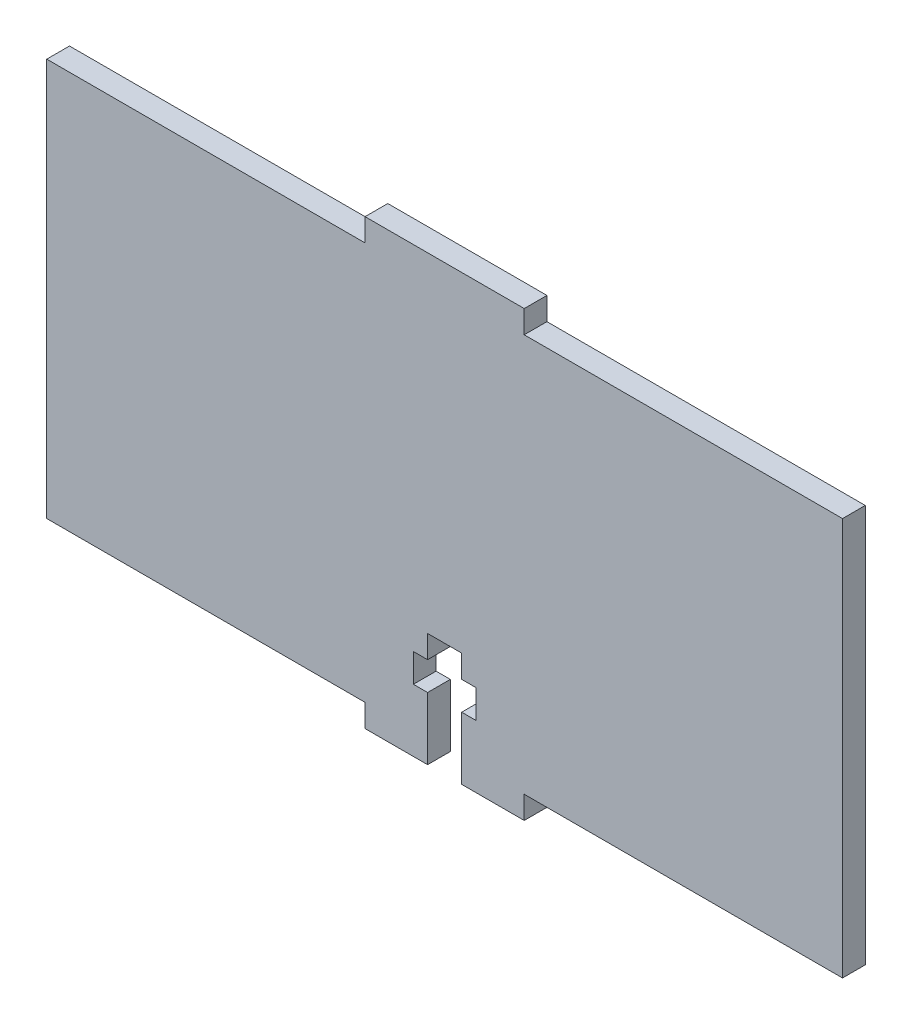
ISO-10303-21;
HEADER;
FILE_DESCRIPTION(('STEP AP214'),'2;1');
FILE_NAME('part.step','',(''),(''),'','','');
FILE_SCHEMA(('AUTOMOTIVE_DESIGN { 1 0 10303 214 1 1 1 1 }'));
ENDSEC;
DATA;
#1=APPLICATION_CONTEXT('core data for automotive mechanical design processes');
#2=APPLICATION_PROTOCOL_DEFINITION('international standard','automotive_design',2000,#1);
#3=PRODUCT_CONTEXT('',#1,'mechanical');
#4=PRODUCT('Part','Part','',(#3));
#5=PRODUCT_RELATED_PRODUCT_CATEGORY('part','',(#4));
#6=PRODUCT_DEFINITION_FORMATION('','',#4);
#7=PRODUCT_DEFINITION_CONTEXT('part definition',#1,'design');
#8=PRODUCT_DEFINITION('design','',#6,#7);
#9=PRODUCT_DEFINITION_SHAPE('','',#8);
#10=(LENGTH_UNIT() NAMED_UNIT(*) SI_UNIT(.MILLI.,.METRE.));
#11=(NAMED_UNIT(*) PLANE_ANGLE_UNIT() SI_UNIT($,.RADIAN.));
#12=(NAMED_UNIT(*) SI_UNIT($,.STERADIAN.) SOLID_ANGLE_UNIT());
#13=UNCERTAINTY_MEASURE_WITH_UNIT(LENGTH_MEASURE(1.E-05),#10,'distance_accuracy_value','');
#14=(GEOMETRIC_REPRESENTATION_CONTEXT(3) GLOBAL_UNCERTAINTY_ASSIGNED_CONTEXT((#13)) GLOBAL_UNIT_ASSIGNED_CONTEXT((#10,
#11,#12)) REPRESENTATION_CONTEXT('',''));
#15=CARTESIAN_POINT('',(0.,0.,0.));
#16=DIRECTION('',(0.,0.,1.));
#17=DIRECTION('',(1.,0.,0.));
#18=AXIS2_PLACEMENT_3D('',#15,#16,#17);
#19=CARTESIAN_POINT('',(0.,0.,2.));
#20=DIRECTION('',(1.,0.,0.));
#21=DIRECTION('',(0.,0.,-1.));
#22=AXIS2_PLACEMENT_3D('',#19,#20,#21);
#23=PLANE('',#22);
#24=DIRECTION('',(0.,-1.,0.));
#25=VECTOR('',#24,1.);
#26=CARTESIAN_POINT('',(0.,0.,0.));
#27=LINE('',#26,#25);
#28=CARTESIAN_POINT('',(0.,35.,0.));
#29=VERTEX_POINT('',#28);
#30=CARTESIAN_POINT('',(0.,0.,0.));
#31=VERTEX_POINT('',#30);
#32=EDGE_CURVE('E224',#29,#31,#27,.T.);
#33=ORIENTED_EDGE('',*,*,#32,.T.);
#34=DIRECTION('',(0.,0.,-1.));
#35=VECTOR('',#34,1.);
#36=CARTESIAN_POINT('',(0.,0.,2.));
#37=LINE('',#36,#35);
#38=CARTESIAN_POINT('',(0.,0.,2.));
#39=VERTEX_POINT('',#38);
#40=EDGE_CURVE('E11',#39,#31,#37,.T.);
#41=ORIENTED_EDGE('',*,*,#40,.F.);
#42=DIRECTION('',(0.,-1.,0.));
#43=VECTOR('',#42,1.);
#44=CARTESIAN_POINT('',(0.,0.,2.));
#45=LINE('',#44,#43);
#46=CARTESIAN_POINT('',(0.,35.,2.));
#47=VERTEX_POINT('',#46);
#48=EDGE_CURVE('E270',#47,#39,#45,.T.);
#49=ORIENTED_EDGE('',*,*,#48,.F.);
#50=DIRECTION('',(0.,0.,-1.));
#51=VECTOR('',#50,1.);
#52=CARTESIAN_POINT('',(0.,35.,2.));
#53=LINE('',#52,#51);
#54=EDGE_CURVE('E220',#47,#29,#53,.T.);
#55=ORIENTED_EDGE('',*,*,#54,.T.);
#56=EDGE_LOOP('',(#33,#41,#49,#55));
#57=FACE_BOUND('',#56,.T.);
#58=ADVANCED_FACE('F32',(#57),#23,.F.);
#59=CARTESIAN_POINT('',(0.,0.,2.));
#60=DIRECTION('',(0.,1.,0.));
#61=DIRECTION('',(0.,0.,1.));
#62=AXIS2_PLACEMENT_3D('',#59,#60,#61);
#63=PLANE('',#62);
#64=DIRECTION('',(1.,0.,0.));
#65=VECTOR('',#64,1.);
#66=CARTESIAN_POINT('',(0.,0.,0.));
#67=LINE('',#66,#65);
#68=CARTESIAN_POINT('',(28.,0.,0.));
#69=VERTEX_POINT('',#68);
#70=EDGE_CURVE('E227',#31,#69,#67,.T.);
#71=ORIENTED_EDGE('',*,*,#70,.T.);
#72=DIRECTION('',(0.,0.,-1.));
#73=VECTOR('',#72,1.);
#74=CARTESIAN_POINT('',(28.,0.,2.));
#75=LINE('',#74,#73);
#76=CARTESIAN_POINT('',(28.,0.,2.));
#77=VERTEX_POINT('',#76);
#78=EDGE_CURVE('E40',#77,#69,#75,.T.);
#79=ORIENTED_EDGE('',*,*,#78,.F.);
#80=DIRECTION('',(1.,0.,0.));
#81=VECTOR('',#80,1.);
#82=CARTESIAN_POINT('',(0.,0.,2.));
#83=LINE('',#82,#81);
#84=EDGE_CURVE('E139',#39,#77,#83,.T.);
#85=ORIENTED_EDGE('',*,*,#84,.F.);
#86=ORIENTED_EDGE('',*,*,#40,.T.);
#87=EDGE_LOOP('',(#71,#79,#85,#86));
#88=FACE_BOUND('',#87,.T.);
#89=ADVANCED_FACE('F408',(#88),#63,.F.);
#90=CARTESIAN_POINT('',(28.,0.,2.));
#91=DIRECTION('',(1.,0.,0.));
#92=DIRECTION('',(0.,1.,0.));
#93=AXIS2_PLACEMENT_3D('',#90,#91,#92);
#94=PLANE('',#93);
#95=DIRECTION('',(0.,-1.,0.));
#96=VECTOR('',#95,1.);
#97=CARTESIAN_POINT('',(28.,0.,0.));
#98=LINE('',#97,#96);
#99=CARTESIAN_POINT('',(28.,-2.,0.));
#100=VERTEX_POINT('',#99);
#101=EDGE_CURVE('E229',#69,#100,#98,.T.);
#102=ORIENTED_EDGE('',*,*,#101,.T.);
#103=DIRECTION('',(0.,0.,-1.));
#104=VECTOR('',#103,1.);
#105=CARTESIAN_POINT('',(28.,-2.,2.));
#106=LINE('',#105,#104);
#107=CARTESIAN_POINT('',(28.,-2.,2.));
#108=VERTEX_POINT('',#107);
#109=EDGE_CURVE('E325',#108,#100,#106,.T.);
#110=ORIENTED_EDGE('',*,*,#109,.F.);
#111=DIRECTION('',(0.,-1.,0.));
#112=VECTOR('',#111,1.);
#113=CARTESIAN_POINT('',(28.,0.,2.));
#114=LINE('',#113,#112);
#115=EDGE_CURVE('E333',#77,#108,#114,.T.);
#116=ORIENTED_EDGE('',*,*,#115,.F.);
#117=ORIENTED_EDGE('',*,*,#78,.T.);
#118=EDGE_LOOP('',(#102,#110,#116,#117));
#119=FACE_BOUND('',#118,.T.);
#120=ADVANCED_FACE('F331',(#119),#94,.F.);
#121=CARTESIAN_POINT('',(28.,-2.,2.));
#122=DIRECTION('',(0.,1.,0.));
#123=DIRECTION('',(0.,0.,1.));
#124=AXIS2_PLACEMENT_3D('',#121,#122,#123);
#125=PLANE('',#124);
#126=DIRECTION('',(1.,0.,0.));
#127=VECTOR('',#126,1.);
#128=CARTESIAN_POINT('',(28.,-2.,0.));
#129=LINE('',#128,#127);
#130=CARTESIAN_POINT('',(33.5,-2.,0.));
#131=VERTEX_POINT('',#130);
#132=EDGE_CURVE('E231',#100,#131,#129,.T.);
#133=ORIENTED_EDGE('',*,*,#132,.T.);
#134=DIRECTION('',(0.,0.,-1.));
#135=VECTOR('',#134,1.);
#136=CARTESIAN_POINT('',(33.5,-2.,2.));
#137=LINE('',#136,#135);
#138=CARTESIAN_POINT('',(33.5,-2.,2.));
#139=VERTEX_POINT('',#138);
#140=EDGE_CURVE('E322',#139,#131,#137,.T.);
#141=ORIENTED_EDGE('',*,*,#140,.F.);
#142=DIRECTION('',(1.,0.,0.));
#143=VECTOR('',#142,1.);
#144=CARTESIAN_POINT('',(28.,-2.,2.));
#145=LINE('',#144,#143);
#146=EDGE_CURVE('E351',#108,#139,#145,.T.);
#147=ORIENTED_EDGE('',*,*,#146,.F.);
#148=ORIENTED_EDGE('',*,*,#109,.T.);
#149=EDGE_LOOP('',(#133,#141,#147,#148));
#150=FACE_BOUND('',#149,.T.);
#151=ADVANCED_FACE('F342',(#150),#125,.F.);
#152=CARTESIAN_POINT('',(33.5,-2.,2.));
#153=DIRECTION('',(-1.,0.,0.));
#154=DIRECTION('',(0.,0.,1.));
#155=AXIS2_PLACEMENT_3D('',#152,#153,#154);
#156=PLANE('',#155);
#157=DIRECTION('',(0.,1.,0.));
#158=VECTOR('',#157,1.);
#159=CARTESIAN_POINT('',(33.5,-2.,0.));
#160=LINE('',#159,#158);
#161=CARTESIAN_POINT('',(33.5,3.5,0.));
#162=VERTEX_POINT('',#161);
#163=EDGE_CURVE('E233',#131,#162,#160,.T.);
#164=ORIENTED_EDGE('',*,*,#163,.T.);
#165=DIRECTION('',(0.,0.,-1.));
#166=VECTOR('',#165,1.);
#167=CARTESIAN_POINT('',(33.5,3.5,2.));
#168=LINE('',#167,#166);
#169=CARTESIAN_POINT('',(33.5,3.5,2.));
#170=VERTEX_POINT('',#169);
#171=EDGE_CURVE('E319',#170,#162,#168,.T.);
#172=ORIENTED_EDGE('',*,*,#171,.F.);
#173=DIRECTION('',(0.,1.,0.));
#174=VECTOR('',#173,1.);
#175=CARTESIAN_POINT('',(33.5,-2.,2.));
#176=LINE('',#175,#174);
#177=EDGE_CURVE('E348',#139,#170,#176,.T.);
#178=ORIENTED_EDGE('',*,*,#177,.F.);
#179=ORIENTED_EDGE('',*,*,#140,.T.);
#180=EDGE_LOOP('',(#164,#172,#178,#179));
#181=FACE_BOUND('',#180,.T.);
#182=ADVANCED_FACE('F346',(#181),#156,.F.);
#183=CARTESIAN_POINT('',(33.5,3.5,2.));
#184=DIRECTION('',(0.,-1.,0.));
#185=DIRECTION('',(1.,0.,0.));
#186=AXIS2_PLACEMENT_3D('',#183,#184,#185);
#187=PLANE('',#186);
#188=DIRECTION('',(-1.,0.,0.));
#189=VECTOR('',#188,1.);
#190=CARTESIAN_POINT('',(33.5,3.5,0.));
#191=LINE('',#190,#189);
#192=CARTESIAN_POINT('',(32.25,3.5,0.));
#193=VERTEX_POINT('',#192);
#194=EDGE_CURVE('E235',#162,#193,#191,.T.);
#195=ORIENTED_EDGE('',*,*,#194,.T.);
#196=DIRECTION('',(0.,0.,-1.));
#197=VECTOR('',#196,1.);
#198=CARTESIAN_POINT('',(32.25,3.5,2.));
#199=LINE('',#198,#197);
#200=CARTESIAN_POINT('',(32.25,3.5,2.));
#201=VERTEX_POINT('',#200);
#202=EDGE_CURVE('E316',#201,#193,#199,.T.);
#203=ORIENTED_EDGE('',*,*,#202,.F.);
#204=DIRECTION('',(-1.,0.,0.));
#205=VECTOR('',#204,1.);
#206=CARTESIAN_POINT('',(33.5,3.5,2.));
#207=LINE('',#206,#205);
#208=EDGE_CURVE('E350',#170,#201,#207,.T.);
#209=ORIENTED_EDGE('',*,*,#208,.F.);
#210=ORIENTED_EDGE('',*,*,#171,.T.);
#211=EDGE_LOOP('',(#195,#203,#209,#210));
#212=FACE_BOUND('',#211,.T.);
#213=ADVANCED_FACE('F421',(#212),#187,.F.);
#214=CARTESIAN_POINT('',(32.25,3.5,2.));
#215=DIRECTION('',(-1.,0.,0.));
#216=DIRECTION('',(0.,0.,1.));
#217=AXIS2_PLACEMENT_3D('',#214,#215,#216);
#218=PLANE('',#217);
#219=DIRECTION('',(0.,1.,0.));
#220=VECTOR('',#219,1.);
#221=CARTESIAN_POINT('',(32.25,3.5,0.));
#222=LINE('',#221,#220);
#223=CARTESIAN_POINT('',(32.25,6.,0.));
#224=VERTEX_POINT('',#223);
#225=EDGE_CURVE('E237',#193,#224,#222,.T.);
#226=ORIENTED_EDGE('',*,*,#225,.T.);
#227=DIRECTION('',(0.,0.,-1.));
#228=VECTOR('',#227,1.);
#229=CARTESIAN_POINT('',(32.25,6.,2.));
#230=LINE('',#229,#228);
#231=CARTESIAN_POINT('',(32.25,6.,2.));
#232=VERTEX_POINT('',#231);
#233=EDGE_CURVE('E313',#232,#224,#230,.T.);
#234=ORIENTED_EDGE('',*,*,#233,.F.);
#235=DIRECTION('',(0.,1.,0.));
#236=VECTOR('',#235,1.);
#237=CARTESIAN_POINT('',(32.25,3.5,2.));
#238=LINE('',#237,#236);
#239=EDGE_CURVE('E353',#201,#232,#238,.T.);
#240=ORIENTED_EDGE('',*,*,#239,.F.);
#241=ORIENTED_EDGE('',*,*,#202,.T.);
#242=EDGE_LOOP('',(#226,#234,#240,#241));
#243=FACE_BOUND('',#242,.T.);
#244=ADVANCED_FACE('F424',(#243),#218,.F.);
#245=CARTESIAN_POINT('',(32.25,6.,2.));
#246=DIRECTION('',(0.,1.,0.));
#247=DIRECTION('',(0.,0.,1.));
#248=AXIS2_PLACEMENT_3D('',#245,#246,#247);
#249=PLANE('',#248);
#250=DIRECTION('',(1.,0.,0.));
#251=VECTOR('',#250,1.);
#252=CARTESIAN_POINT('',(32.25,6.,0.));
#253=LINE('',#252,#251);
#254=CARTESIAN_POINT('',(33.5,6.,0.));
#255=VERTEX_POINT('',#254);
#256=EDGE_CURVE('E239',#224,#255,#253,.T.);
#257=ORIENTED_EDGE('',*,*,#256,.T.);
#258=DIRECTION('',(0.,0.,-1.));
#259=VECTOR('',#258,1.);
#260=CARTESIAN_POINT('',(33.5,6.,2.));
#261=LINE('',#260,#259);
#262=CARTESIAN_POINT('',(33.5,6.,2.));
#263=VERTEX_POINT('',#262);
#264=EDGE_CURVE('E310',#263,#255,#261,.T.);
#265=ORIENTED_EDGE('',*,*,#264,.F.);
#266=DIRECTION('',(1.,0.,0.));
#267=VECTOR('',#266,1.);
#268=CARTESIAN_POINT('',(32.25,6.,2.));
#269=LINE('',#268,#267);
#270=EDGE_CURVE('E359',#232,#263,#269,.T.);
#271=ORIENTED_EDGE('',*,*,#270,.F.);
#272=ORIENTED_EDGE('',*,*,#233,.T.);
#273=EDGE_LOOP('',(#257,#265,#271,#272));
#274=FACE_BOUND('',#273,.T.);
#275=ADVANCED_FACE('F428',(#274),#249,.F.);
#276=CARTESIAN_POINT('',(33.5,8.,2.));
#277=DIRECTION('',(-1.,0.,0.));
#278=DIRECTION('',(0.,0.,1.));
#279=AXIS2_PLACEMENT_3D('',#276,#277,#278);
#280=PLANE('',#279);
#281=DIRECTION('',(0.,1.,0.));
#282=VECTOR('',#281,1.);
#283=CARTESIAN_POINT('',(33.5,8.,0.));
#284=LINE('',#283,#282);
#285=CARTESIAN_POINT('',(33.5,8.,0.));
#286=VERTEX_POINT('',#285);
#287=EDGE_CURVE('E241',#255,#286,#284,.T.);
#288=ORIENTED_EDGE('',*,*,#287,.T.);
#289=DIRECTION('',(0.,0.,-1.));
#290=VECTOR('',#289,1.);
#291=CARTESIAN_POINT('',(33.5,8.,2.));
#292=LINE('',#291,#290);
#293=CARTESIAN_POINT('',(33.5,8.,2.));
#294=VERTEX_POINT('',#293);
#295=EDGE_CURVE('E307',#294,#286,#292,.T.);
#296=ORIENTED_EDGE('',*,*,#295,.F.);
#297=DIRECTION('',(0.,1.,0.));
#298=VECTOR('',#297,1.);
#299=CARTESIAN_POINT('',(33.5,8.,2.));
#300=LINE('',#299,#298);
#301=EDGE_CURVE('E361',#263,#294,#300,.T.);
#302=ORIENTED_EDGE('',*,*,#301,.F.);
#303=ORIENTED_EDGE('',*,*,#264,.T.);
#304=EDGE_LOOP('',(#288,#296,#302,#303));
#305=FACE_BOUND('',#304,.T.);
#306=ADVANCED_FACE('F432',(#305),#280,.F.);
#307=CARTESIAN_POINT('',(36.5,8.,2.));
#308=DIRECTION('',(0.,1.,0.));
#309=DIRECTION('',(0.,0.,1.));
#310=AXIS2_PLACEMENT_3D('',#307,#308,#309);
#311=PLANE('',#310);
#312=DIRECTION('',(1.,0.,0.));
#313=VECTOR('',#312,1.);
#314=CARTESIAN_POINT('',(36.5,8.,0.));
#315=LINE('',#314,#313);
#316=CARTESIAN_POINT('',(36.5,8.,0.));
#317=VERTEX_POINT('',#316);
#318=EDGE_CURVE('E243',#286,#317,#315,.T.);
#319=ORIENTED_EDGE('',*,*,#318,.T.);
#320=DIRECTION('',(0.,0.,-1.));
#321=VECTOR('',#320,1.);
#322=CARTESIAN_POINT('',(36.5,8.,2.));
#323=LINE('',#322,#321);
#324=CARTESIAN_POINT('',(36.5,8.,2.));
#325=VERTEX_POINT('',#324);
#326=EDGE_CURVE('E304',#325,#317,#323,.T.);
#327=ORIENTED_EDGE('',*,*,#326,.F.);
#328=DIRECTION('',(1.,0.,0.));
#329=VECTOR('',#328,1.);
#330=CARTESIAN_POINT('',(36.5,8.,2.));
#331=LINE('',#330,#329);
#332=EDGE_CURVE('E363',#294,#325,#331,.T.);
#333=ORIENTED_EDGE('',*,*,#332,.F.);
#334=ORIENTED_EDGE('',*,*,#295,.T.);
#335=EDGE_LOOP('',(#319,#327,#333,#334));
#336=FACE_BOUND('',#335,.T.);
#337=ADVANCED_FACE('F436',(#336),#311,.F.);
#338=CARTESIAN_POINT('',(36.5,6.,2.));
#339=DIRECTION('',(1.,0.,0.));
#340=DIRECTION('',(0.,0.,-1.));
#341=AXIS2_PLACEMENT_3D('',#338,#339,#340);
#342=PLANE('',#341);
#343=DIRECTION('',(0.,-1.,0.));
#344=VECTOR('',#343,1.);
#345=CARTESIAN_POINT('',(36.5,6.,0.));
#346=LINE('',#345,#344);
#347=CARTESIAN_POINT('',(36.5,6.,0.));
#348=VERTEX_POINT('',#347);
#349=EDGE_CURVE('E245',#317,#348,#346,.T.);
#350=ORIENTED_EDGE('',*,*,#349,.T.);
#351=DIRECTION('',(0.,0.,-1.));
#352=VECTOR('',#351,1.);
#353=CARTESIAN_POINT('',(36.5,6.,2.));
#354=LINE('',#353,#352);
#355=CARTESIAN_POINT('',(36.5,6.,2.));
#356=VERTEX_POINT('',#355);
#357=EDGE_CURVE('E301',#356,#348,#354,.T.);
#358=ORIENTED_EDGE('',*,*,#357,.F.);
#359=DIRECTION('',(0.,-1.,0.));
#360=VECTOR('',#359,1.);
#361=CARTESIAN_POINT('',(36.5,6.,2.));
#362=LINE('',#361,#360);
#363=EDGE_CURVE('E365',#325,#356,#362,.T.);
#364=ORIENTED_EDGE('',*,*,#363,.F.);
#365=ORIENTED_EDGE('',*,*,#326,.T.);
#366=EDGE_LOOP('',(#350,#358,#364,#365));
#367=FACE_BOUND('',#366,.T.);
#368=ADVANCED_FACE('F440',(#367),#342,.F.);
#369=CARTESIAN_POINT('',(36.5,6.,2.));
#370=DIRECTION('',(0.,1.,0.));
#371=DIRECTION('',(0.,0.,1.));
#372=AXIS2_PLACEMENT_3D('',#369,#370,#371);
#373=PLANE('',#372);
#374=DIRECTION('',(1.,0.,0.));
#375=VECTOR('',#374,1.);
#376=CARTESIAN_POINT('',(36.5,6.,0.));
#377=LINE('',#376,#375);
#378=CARTESIAN_POINT('',(37.75,6.,0.));
#379=VERTEX_POINT('',#378);
#380=EDGE_CURVE('E247',#348,#379,#377,.T.);
#381=ORIENTED_EDGE('',*,*,#380,.T.);
#382=DIRECTION('',(0.,0.,-1.));
#383=VECTOR('',#382,1.);
#384=CARTESIAN_POINT('',(37.75,6.,2.));
#385=LINE('',#384,#383);
#386=CARTESIAN_POINT('',(37.75,6.,2.));
#387=VERTEX_POINT('',#386);
#388=EDGE_CURVE('E298',#387,#379,#385,.T.);
#389=ORIENTED_EDGE('',*,*,#388,.F.);
#390=DIRECTION('',(1.,0.,0.));
#391=VECTOR('',#390,1.);
#392=CARTESIAN_POINT('',(36.5,6.,2.));
#393=LINE('',#392,#391);
#394=EDGE_CURVE('E367',#356,#387,#393,.T.);
#395=ORIENTED_EDGE('',*,*,#394,.F.);
#396=ORIENTED_EDGE('',*,*,#357,.T.);
#397=EDGE_LOOP('',(#381,#389,#395,#396));
#398=FACE_BOUND('',#397,.T.);
#399=ADVANCED_FACE('F444',(#398),#373,.F.);
#400=CARTESIAN_POINT('',(37.75,6.,2.));
#401=DIRECTION('',(1.,0.,0.));
#402=DIRECTION('',(0.,0.,-1.));
#403=AXIS2_PLACEMENT_3D('',#400,#401,#402);
#404=PLANE('',#403);
#405=DIRECTION('',(0.,-1.,0.));
#406=VECTOR('',#405,1.);
#407=CARTESIAN_POINT('',(37.75,6.,0.));
#408=LINE('',#407,#406);
#409=CARTESIAN_POINT('',(37.75,3.5,0.));
#410=VERTEX_POINT('',#409);
#411=EDGE_CURVE('E249',#379,#410,#408,.T.);
#412=ORIENTED_EDGE('',*,*,#411,.T.);
#413=DIRECTION('',(0.,0.,-1.));
#414=VECTOR('',#413,1.);
#415=CARTESIAN_POINT('',(37.75,3.5,2.));
#416=LINE('',#415,#414);
#417=CARTESIAN_POINT('',(37.75,3.5,2.));
#418=VERTEX_POINT('',#417);
#419=EDGE_CURVE('E295',#418,#410,#416,.T.);
#420=ORIENTED_EDGE('',*,*,#419,.F.);
#421=DIRECTION('',(0.,-1.,0.));
#422=VECTOR('',#421,1.);
#423=CARTESIAN_POINT('',(37.75,6.,2.));
#424=LINE('',#423,#422);
#425=EDGE_CURVE('E369',#387,#418,#424,.T.);
#426=ORIENTED_EDGE('',*,*,#425,.F.);
#427=ORIENTED_EDGE('',*,*,#388,.T.);
#428=EDGE_LOOP('',(#412,#420,#426,#427));
#429=FACE_BOUND('',#428,.T.);
#430=ADVANCED_FACE('F448',(#429),#404,.F.);
#431=CARTESIAN_POINT('',(37.75,3.5,2.));
#432=DIRECTION('',(0.,-1.,0.));
#433=DIRECTION('',(1.,0.,0.));
#434=AXIS2_PLACEMENT_3D('',#431,#432,#433);
#435=PLANE('',#434);
#436=DIRECTION('',(-1.,0.,0.));
#437=VECTOR('',#436,1.);
#438=CARTESIAN_POINT('',(37.75,3.5,0.));
#439=LINE('',#438,#437);
#440=CARTESIAN_POINT('',(36.5,3.5,0.));
#441=VERTEX_POINT('',#440);
#442=EDGE_CURVE('E251',#410,#441,#439,.T.);
#443=ORIENTED_EDGE('',*,*,#442,.T.);
#444=DIRECTION('',(0.,0.,-1.));
#445=VECTOR('',#444,1.);
#446=CARTESIAN_POINT('',(36.5,3.5,2.));
#447=LINE('',#446,#445);
#448=CARTESIAN_POINT('',(36.5,3.5,2.));
#449=VERTEX_POINT('',#448);
#450=EDGE_CURVE('E292',#449,#441,#447,.T.);
#451=ORIENTED_EDGE('',*,*,#450,.F.);
#452=DIRECTION('',(-1.,0.,0.));
#453=VECTOR('',#452,1.);
#454=CARTESIAN_POINT('',(37.75,3.5,2.));
#455=LINE('',#454,#453);
#456=EDGE_CURVE('E371',#418,#449,#455,.T.);
#457=ORIENTED_EDGE('',*,*,#456,.F.);
#458=ORIENTED_EDGE('',*,*,#419,.T.);
#459=EDGE_LOOP('',(#443,#451,#457,#458));
#460=FACE_BOUND('',#459,.T.);
#461=ADVANCED_FACE('F452',(#460),#435,.F.);
#462=CARTESIAN_POINT('',(36.5,3.5,2.));
#463=DIRECTION('',(1.,0.,0.));
#464=DIRECTION('',(0.,0.,-1.));
#465=AXIS2_PLACEMENT_3D('',#462,#463,#464);
#466=PLANE('',#465);
#467=DIRECTION('',(0.,-1.,0.));
#468=VECTOR('',#467,1.);
#469=CARTESIAN_POINT('',(36.5,3.5,0.));
#470=LINE('',#469,#468);
#471=CARTESIAN_POINT('',(36.5,-2.,0.));
#472=VERTEX_POINT('',#471);
#473=EDGE_CURVE('E253',#441,#472,#470,.T.);
#474=ORIENTED_EDGE('',*,*,#473,.T.);
#475=DIRECTION('',(0.,0.,-1.));
#476=VECTOR('',#475,1.);
#477=CARTESIAN_POINT('',(36.5,-2.,2.));
#478=LINE('',#477,#476);
#479=CARTESIAN_POINT('',(36.5,-2.,2.));
#480=VERTEX_POINT('',#479);
#481=EDGE_CURVE('E289',#480,#472,#478,.T.);
#482=ORIENTED_EDGE('',*,*,#481,.F.);
#483=DIRECTION('',(0.,-1.,0.));
#484=VECTOR('',#483,1.);
#485=CARTESIAN_POINT('',(36.5,3.5,2.));
#486=LINE('',#485,#484);
#487=EDGE_CURVE('E373',#449,#480,#486,.T.);
#488=ORIENTED_EDGE('',*,*,#487,.F.);
#489=ORIENTED_EDGE('',*,*,#450,.T.);
#490=EDGE_LOOP('',(#474,#482,#488,#489));
#491=FACE_BOUND('',#490,.T.);
#492=ADVANCED_FACE('F456',(#491),#466,.F.);
#493=CARTESIAN_POINT('',(36.5,-2.,2.));
#494=DIRECTION('',(0.,1.,0.));
#495=DIRECTION('',(0.,0.,1.));
#496=AXIS2_PLACEMENT_3D('',#493,#494,#495);
#497=PLANE('',#496);
#498=DIRECTION('',(1.,0.,0.));
#499=VECTOR('',#498,1.);
#500=CARTESIAN_POINT('',(36.5,-2.,0.));
#501=LINE('',#500,#499);
#502=CARTESIAN_POINT('',(42.,-2.,0.));
#503=VERTEX_POINT('',#502);
#504=EDGE_CURVE('E255',#472,#503,#501,.T.);
#505=ORIENTED_EDGE('',*,*,#504,.T.);
#506=DIRECTION('',(0.,0.,-1.));
#507=VECTOR('',#506,1.);
#508=CARTESIAN_POINT('',(42.,-2.,2.));
#509=LINE('',#508,#507);
#510=CARTESIAN_POINT('',(42.,-2.,2.));
#511=VERTEX_POINT('',#510);
#512=EDGE_CURVE('E286',#511,#503,#509,.T.);
#513=ORIENTED_EDGE('',*,*,#512,.F.);
#514=DIRECTION('',(1.,0.,0.));
#515=VECTOR('',#514,1.);
#516=CARTESIAN_POINT('',(36.5,-2.,2.));
#517=LINE('',#516,#515);
#518=EDGE_CURVE('E375',#480,#511,#517,.T.);
#519=ORIENTED_EDGE('',*,*,#518,.F.);
#520=ORIENTED_EDGE('',*,*,#481,.T.);
#521=EDGE_LOOP('',(#505,#513,#519,#520));
#522=FACE_BOUND('',#521,.T.);
#523=ADVANCED_FACE('F460',(#522),#497,.F.);
#524=CARTESIAN_POINT('',(42.,0.,2.));
#525=DIRECTION('',(-1.,0.,0.));
#526=DIRECTION('',(0.,-1.,0.));
#527=AXIS2_PLACEMENT_3D('',#524,#525,#526);
#528=PLANE('',#527);
#529=DIRECTION('',(0.,1.,0.));
#530=VECTOR('',#529,1.);
#531=CARTESIAN_POINT('',(42.,0.,0.));
#532=LINE('',#531,#530);
#533=CARTESIAN_POINT('',(42.,0.,0.));
#534=VERTEX_POINT('',#533);
#535=EDGE_CURVE('E257',#503,#534,#532,.T.);
#536=ORIENTED_EDGE('',*,*,#535,.T.);
#537=DIRECTION('',(0.,0.,-1.));
#538=VECTOR('',#537,1.);
#539=CARTESIAN_POINT('',(42.,0.,2.));
#540=LINE('',#539,#538);
#541=CARTESIAN_POINT('',(42.,0.,2.));
#542=VERTEX_POINT('',#541);
#543=EDGE_CURVE('E283',#542,#534,#540,.T.);
#544=ORIENTED_EDGE('',*,*,#543,.F.);
#545=DIRECTION('',(0.,1.,0.));
#546=VECTOR('',#545,1.);
#547=CARTESIAN_POINT('',(42.,0.,2.));
#548=LINE('',#547,#546);
#549=EDGE_CURVE('E377',#511,#542,#548,.T.);
#550=ORIENTED_EDGE('',*,*,#549,.F.);
#551=ORIENTED_EDGE('',*,*,#512,.T.);
#552=EDGE_LOOP('',(#536,#544,#550,#551));
#553=FACE_BOUND('',#552,.T.);
#554=ADVANCED_FACE('F464',(#553),#528,.F.);
#555=CARTESIAN_POINT('',(42.,0.,2.));
#556=DIRECTION('',(0.,1.,0.));
#557=DIRECTION('',(0.,0.,1.));
#558=AXIS2_PLACEMENT_3D('',#555,#556,#557);
#559=PLANE('',#558);
#560=DIRECTION('',(1.,0.,0.));
#561=VECTOR('',#560,1.);
#562=CARTESIAN_POINT('',(42.,0.,0.));
#563=LINE('',#562,#561);
#564=CARTESIAN_POINT('',(70.,0.,0.));
#565=VERTEX_POINT('',#564);
#566=EDGE_CURVE('E259',#534,#565,#563,.T.);
#567=ORIENTED_EDGE('',*,*,#566,.T.);
#568=DIRECTION('',(0.,0.,-1.));
#569=VECTOR('',#568,1.);
#570=CARTESIAN_POINT('',(70.,0.,2.));
#571=LINE('',#570,#569);
#572=CARTESIAN_POINT('',(70.,0.,2.));
#573=VERTEX_POINT('',#572);
#574=EDGE_CURVE('E280',#573,#565,#571,.T.);
#575=ORIENTED_EDGE('',*,*,#574,.F.);
#576=DIRECTION('',(1.,0.,0.));
#577=VECTOR('',#576,1.);
#578=CARTESIAN_POINT('',(42.,0.,2.));
#579=LINE('',#578,#577);
#580=EDGE_CURVE('E379',#542,#573,#579,.T.);
#581=ORIENTED_EDGE('',*,*,#580,.F.);
#582=ORIENTED_EDGE('',*,*,#543,.T.);
#583=EDGE_LOOP('',(#567,#575,#581,#582));
#584=FACE_BOUND('',#583,.T.);
#585=ADVANCED_FACE('F468',(#584),#559,.F.);
#586=CARTESIAN_POINT('',(70.,0.,2.));
#587=DIRECTION('',(-1.,0.,0.));
#588=DIRECTION('',(0.,0.,1.));
#589=AXIS2_PLACEMENT_3D('',#586,#587,#588);
#590=PLANE('',#589);
#591=DIRECTION('',(0.,1.,0.));
#592=VECTOR('',#591,1.);
#593=CARTESIAN_POINT('',(70.,0.,0.));
#594=LINE('',#593,#592);
#595=CARTESIAN_POINT('',(70.,35.,0.));
#596=VERTEX_POINT('',#595);
#597=EDGE_CURVE('E261',#565,#596,#594,.T.);
#598=ORIENTED_EDGE('',*,*,#597,.T.);
#599=DIRECTION('',(0.,0.,-1.));
#600=VECTOR('',#599,1.);
#601=CARTESIAN_POINT('',(70.,35.,2.));
#602=LINE('',#601,#600);
#603=CARTESIAN_POINT('',(70.,35.,2.));
#604=VERTEX_POINT('',#603);
#605=EDGE_CURVE('E277',#604,#596,#602,.T.);
#606=ORIENTED_EDGE('',*,*,#605,.F.);
#607=DIRECTION('',(0.,1.,0.));
#608=VECTOR('',#607,1.);
#609=CARTESIAN_POINT('',(70.,0.,2.));
#610=LINE('',#609,#608);
#611=EDGE_CURVE('E381',#573,#604,#610,.T.);
#612=ORIENTED_EDGE('',*,*,#611,.F.);
#613=ORIENTED_EDGE('',*,*,#574,.T.);
#614=EDGE_LOOP('',(#598,#606,#612,#613));
#615=FACE_BOUND('',#614,.T.);
#616=ADVANCED_FACE('F472',(#615),#590,.F.);
#617=CARTESIAN_POINT('',(42.,35.,2.));
#618=DIRECTION('',(0.,-1.,0.));
#619=DIRECTION('',(0.,0.,-1.));
#620=AXIS2_PLACEMENT_3D('',#617,#618,#619);
#621=PLANE('',#620);
#622=DIRECTION('',(-1.,0.,0.));
#623=VECTOR('',#622,1.);
#624=CARTESIAN_POINT('',(42.,35.,0.));
#625=LINE('',#624,#623);
#626=CARTESIAN_POINT('',(42.,35.,0.));
#627=VERTEX_POINT('',#626);
#628=EDGE_CURVE('E263',#596,#627,#625,.T.);
#629=ORIENTED_EDGE('',*,*,#628,.T.);
#630=DIRECTION('',(0.,0.,-1.));
#631=VECTOR('',#630,1.);
#632=CARTESIAN_POINT('',(42.,35.,2.));
#633=LINE('',#632,#631);
#634=CARTESIAN_POINT('',(42.,35.,2.));
#635=VERTEX_POINT('',#634);
#636=EDGE_CURVE('E274',#635,#627,#633,.T.);
#637=ORIENTED_EDGE('',*,*,#636,.F.);
#638=DIRECTION('',(-1.,0.,0.));
#639=VECTOR('',#638,1.);
#640=CARTESIAN_POINT('',(42.,35.,2.));
#641=LINE('',#640,#639);
#642=EDGE_CURVE('E383',#604,#635,#641,.T.);
#643=ORIENTED_EDGE('',*,*,#642,.F.);
#644=ORIENTED_EDGE('',*,*,#605,.T.);
#645=EDGE_LOOP('',(#629,#637,#643,#644));
#646=FACE_BOUND('',#645,.T.);
#647=ADVANCED_FACE('F389',(#646),#621,.F.);
#648=CARTESIAN_POINT('',(42.,35.,2.));
#649=DIRECTION('',(-1.,0.,0.));
#650=DIRECTION('',(0.,0.,1.));
#651=AXIS2_PLACEMENT_3D('',#648,#649,#650);
#652=PLANE('',#651);
#653=DIRECTION('',(0.,1.,0.));
#654=VECTOR('',#653,1.);
#655=CARTESIAN_POINT('',(42.,35.,0.));
#656=LINE('',#655,#654);
#657=CARTESIAN_POINT('',(42.,37.,0.));
#658=VERTEX_POINT('',#657);
#659=EDGE_CURVE('E265',#627,#658,#656,.T.);
#660=ORIENTED_EDGE('',*,*,#659,.T.);
#661=DIRECTION('',(0.,0.,-1.));
#662=VECTOR('',#661,1.);
#663=CARTESIAN_POINT('',(42.,37.,2.));
#664=LINE('',#663,#662);
#665=CARTESIAN_POINT('',(42.,37.,2.));
#666=VERTEX_POINT('',#665);
#667=EDGE_CURVE('E215',#666,#658,#664,.T.);
#668=ORIENTED_EDGE('',*,*,#667,.F.);
#669=DIRECTION('',(0.,1.,0.));
#670=VECTOR('',#669,1.);
#671=CARTESIAN_POINT('',(42.,35.,2.));
#672=LINE('',#671,#670);
#673=EDGE_CURVE('E206',#635,#666,#672,.T.);
#674=ORIENTED_EDGE('',*,*,#673,.F.);
#675=ORIENTED_EDGE('',*,*,#636,.T.);
#676=EDGE_LOOP('',(#660,#668,#674,#675));
#677=FACE_BOUND('',#676,.T.);
#678=ADVANCED_FACE('F393',(#677),#652,.F.);
#679=CARTESIAN_POINT('',(28.,37.,2.));
#680=DIRECTION('',(0.,-1.,0.));
#681=DIRECTION('',(0.,0.,-1.));
#682=AXIS2_PLACEMENT_3D('',#679,#680,#681);
#683=PLANE('',#682);
#684=DIRECTION('',(-1.,0.,0.));
#685=VECTOR('',#684,1.);
#686=CARTESIAN_POINT('',(28.,37.,0.));
#687=LINE('',#686,#685);
#688=CARTESIAN_POINT('',(28.,37.,0.));
#689=VERTEX_POINT('',#688);
#690=EDGE_CURVE('E214',#658,#689,#687,.T.);
#691=ORIENTED_EDGE('',*,*,#690,.T.);
#692=DIRECTION('',(0.,0.,-1.));
#693=VECTOR('',#692,1.);
#694=CARTESIAN_POINT('',(28.,37.,2.));
#695=LINE('',#694,#693);
#696=CARTESIAN_POINT('',(28.,37.,2.));
#697=VERTEX_POINT('',#696);
#698=EDGE_CURVE('E211',#697,#689,#695,.T.);
#699=ORIENTED_EDGE('',*,*,#698,.F.);
#700=DIRECTION('',(-1.,0.,0.));
#701=VECTOR('',#700,1.);
#702=CARTESIAN_POINT('',(28.,37.,2.));
#703=LINE('',#702,#701);
#704=EDGE_CURVE('E200',#666,#697,#703,.T.);
#705=ORIENTED_EDGE('',*,*,#704,.F.);
#706=ORIENTED_EDGE('',*,*,#667,.T.);
#707=EDGE_LOOP('',(#691,#699,#705,#706));
#708=FACE_BOUND('',#707,.T.);
#709=ADVANCED_FACE('F212',(#708),#683,.F.);
#710=CARTESIAN_POINT('',(28.,35.,2.));
#711=DIRECTION('',(1.,0.,0.));
#712=DIRECTION('',(0.,1.,0.));
#713=AXIS2_PLACEMENT_3D('',#710,#711,#712);
#714=PLANE('',#713);
#715=DIRECTION('',(0.,-1.,0.));
#716=VECTOR('',#715,1.);
#717=CARTESIAN_POINT('',(28.,35.,0.));
#718=LINE('',#717,#716);
#719=CARTESIAN_POINT('',(28.,35.,0.));
#720=VERTEX_POINT('',#719);
#721=EDGE_CURVE('E125',#689,#720,#718,.T.);
#722=ORIENTED_EDGE('',*,*,#721,.T.);
#723=DIRECTION('',(0.,0.,-1.));
#724=VECTOR('',#723,1.);
#725=CARTESIAN_POINT('',(28.,35.,2.));
#726=LINE('',#725,#724);
#727=CARTESIAN_POINT('',(28.,35.,2.));
#728=VERTEX_POINT('',#727);
#729=EDGE_CURVE('E216',#728,#720,#726,.T.);
#730=ORIENTED_EDGE('',*,*,#729,.F.);
#731=DIRECTION('',(0.,-1.,0.));
#732=VECTOR('',#731,1.);
#733=CARTESIAN_POINT('',(28.,35.,2.));
#734=LINE('',#733,#732);
#735=EDGE_CURVE('E204',#697,#728,#734,.T.);
#736=ORIENTED_EDGE('',*,*,#735,.F.);
#737=ORIENTED_EDGE('',*,*,#698,.T.);
#738=EDGE_LOOP('',(#722,#730,#736,#737));
#739=FACE_BOUND('',#738,.T.);
#740=ADVANCED_FACE('F218',(#739),#714,.F.);
#741=CARTESIAN_POINT('',(0.,35.,2.));
#742=DIRECTION('',(0.,-1.,0.));
#743=DIRECTION('',(0.,0.,-1.));
#744=AXIS2_PLACEMENT_3D('',#741,#742,#743);
#745=PLANE('',#744);
#746=DIRECTION('',(-1.,0.,0.));
#747=VECTOR('',#746,1.);
#748=CARTESIAN_POINT('',(0.,35.,0.));
#749=LINE('',#748,#747);
#750=EDGE_CURVE('E131',#720,#29,#749,.T.);
#751=ORIENTED_EDGE('',*,*,#750,.T.);
#752=ORIENTED_EDGE('',*,*,#54,.F.);
#753=DIRECTION('',(-1.,0.,0.));
#754=VECTOR('',#753,1.);
#755=CARTESIAN_POINT('',(0.,35.,2.));
#756=LINE('',#755,#754);
#757=EDGE_CURVE('E48',#728,#47,#756,.T.);
#758=ORIENTED_EDGE('',*,*,#757,.F.);
#759=ORIENTED_EDGE('',*,*,#729,.T.);
#760=EDGE_LOOP('',(#751,#752,#758,#759));
#761=FACE_BOUND('',#760,.T.);
#762=ADVANCED_FACE('F397',(#761),#745,.F.);
#763=CARTESIAN_POINT('',(0.,0.,2.));
#764=DIRECTION('',(0.,0.,-1.));
#765=DIRECTION('',(-1.,0.,0.));
#766=AXIS2_PLACEMENT_3D('',#763,#764,#765);
#767=PLANE('',#766);
#768=ORIENTED_EDGE('',*,*,#48,.T.);
#769=ORIENTED_EDGE('',*,*,#84,.T.);
#770=ORIENTED_EDGE('',*,*,#115,.T.);
#771=ORIENTED_EDGE('',*,*,#146,.T.);
#772=ORIENTED_EDGE('',*,*,#177,.T.);
#773=ORIENTED_EDGE('',*,*,#208,.T.);
#774=ORIENTED_EDGE('',*,*,#239,.T.);
#775=ORIENTED_EDGE('',*,*,#270,.T.);
#776=ORIENTED_EDGE('',*,*,#301,.T.);
#777=ORIENTED_EDGE('',*,*,#332,.T.);
#778=ORIENTED_EDGE('',*,*,#363,.T.);
#779=ORIENTED_EDGE('',*,*,#394,.T.);
#780=ORIENTED_EDGE('',*,*,#425,.T.);
#781=ORIENTED_EDGE('',*,*,#456,.T.);
#782=ORIENTED_EDGE('',*,*,#487,.T.);
#783=ORIENTED_EDGE('',*,*,#518,.T.);
#784=ORIENTED_EDGE('',*,*,#549,.T.);
#785=ORIENTED_EDGE('',*,*,#580,.T.);
#786=ORIENTED_EDGE('',*,*,#611,.T.);
#787=ORIENTED_EDGE('',*,*,#642,.T.);
#788=ORIENTED_EDGE('',*,*,#673,.T.);
#789=ORIENTED_EDGE('',*,*,#704,.T.);
#790=ORIENTED_EDGE('',*,*,#735,.T.);
#791=ORIENTED_EDGE('',*,*,#757,.T.);
#792=EDGE_LOOP('',(#768,#769,#770,#771,#772,#773,#774,#775,#776,#777,#778,#779,#780,#781,#782,
#783,#784,#785,#786,#787,#788,#789,#790,#791));
#793=FACE_BOUND('',#792,.T.);
#794=ADVANCED_FACE('F202',(#793),#767,.F.);
#795=CARTESIAN_POINT('',(0.,0.,0.));
#796=DIRECTION('',(0.,0.,-1.));
#797=DIRECTION('',(-1.,0.,0.));
#798=AXIS2_PLACEMENT_3D('',#795,#796,#797);
#799=PLANE('',#798);
#800=ORIENTED_EDGE('',*,*,#32,.F.);
#801=ORIENTED_EDGE('',*,*,#750,.F.);
#802=ORIENTED_EDGE('',*,*,#721,.F.);
#803=ORIENTED_EDGE('',*,*,#690,.F.);
#804=ORIENTED_EDGE('',*,*,#659,.F.);
#805=ORIENTED_EDGE('',*,*,#628,.F.);
#806=ORIENTED_EDGE('',*,*,#597,.F.);
#807=ORIENTED_EDGE('',*,*,#566,.F.);
#808=ORIENTED_EDGE('',*,*,#535,.F.);
#809=ORIENTED_EDGE('',*,*,#504,.F.);
#810=ORIENTED_EDGE('',*,*,#473,.F.);
#811=ORIENTED_EDGE('',*,*,#442,.F.);
#812=ORIENTED_EDGE('',*,*,#411,.F.);
#813=ORIENTED_EDGE('',*,*,#380,.F.);
#814=ORIENTED_EDGE('',*,*,#349,.F.);
#815=ORIENTED_EDGE('',*,*,#318,.F.);
#816=ORIENTED_EDGE('',*,*,#287,.F.);
#817=ORIENTED_EDGE('',*,*,#256,.F.);
#818=ORIENTED_EDGE('',*,*,#225,.F.);
#819=ORIENTED_EDGE('',*,*,#194,.F.);
#820=ORIENTED_EDGE('',*,*,#163,.F.);
#821=ORIENTED_EDGE('',*,*,#132,.F.);
#822=ORIENTED_EDGE('',*,*,#101,.F.);
#823=ORIENTED_EDGE('',*,*,#70,.F.);
#824=EDGE_LOOP('',(#800,#801,#802,#803,#804,#805,#806,#807,#808,#809,#810,#811,#812,#813,#814,
#815,#816,#817,#818,#819,#820,#821,#822,#823));
#825=FACE_BOUND('',#824,.T.);
#826=ADVANCED_FACE('F337',(#825),#799,.T.);
#827=CLOSED_SHELL('',(#58,#89,#120,#151,#182,#213,#244,#275,#306,#337,#368,#399,#430,#461,#492,
#523,#554,#585,#616,#647,#678,#709,#740,#762,#794,#826));
#828=MANIFOLD_SOLID_BREP('B2',#827);
#829=ADVANCED_BREP_SHAPE_REPRESENTATION('',(#18,#828),#14);
#830=SHAPE_DEFINITION_REPRESENTATION(#9,#829);
ENDSEC;
END-ISO-10303-21;
